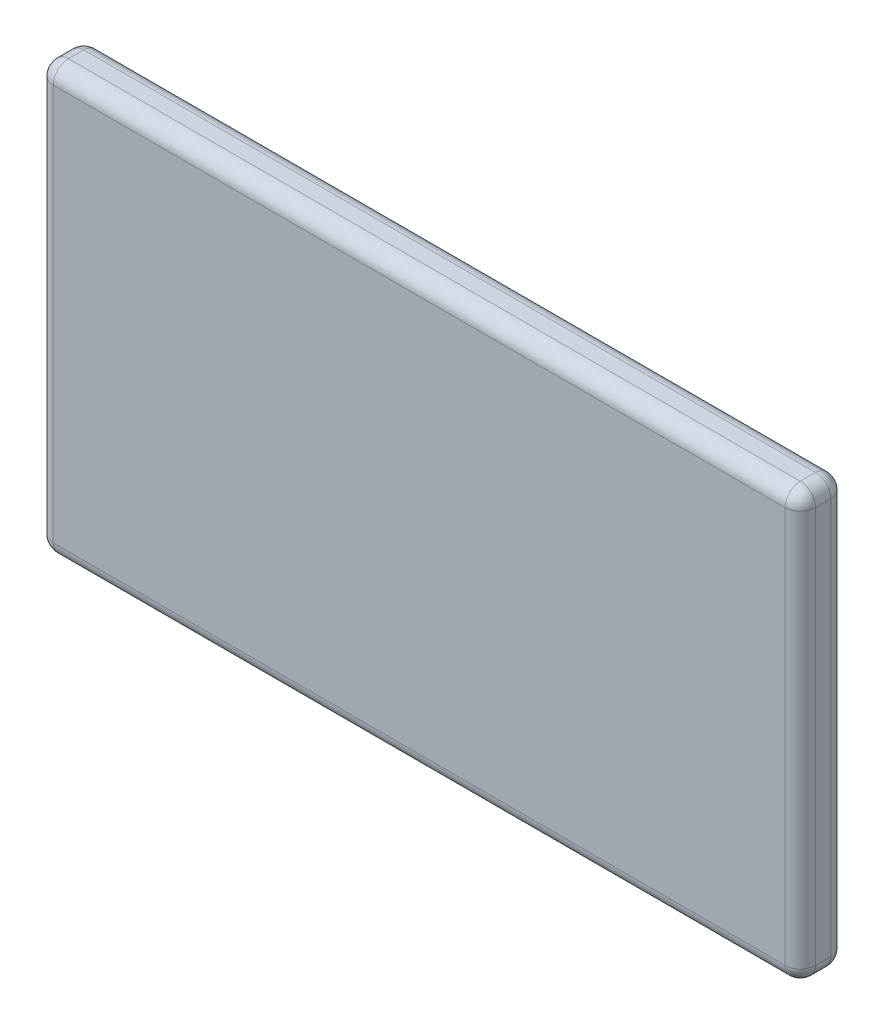
ISO-10303-21;
HEADER;
FILE_DESCRIPTION(('STEP AP214'),'2;1');
FILE_NAME('part.step','',(''),(''),'','','');
FILE_SCHEMA(('AUTOMOTIVE_DESIGN { 1 0 10303 214 1 1 1 1 }'));
ENDSEC;
DATA;
#1=APPLICATION_CONTEXT('core data for automotive mechanical design processes');
#2=APPLICATION_PROTOCOL_DEFINITION('international standard','automotive_design',2000,#1);
#3=PRODUCT_CONTEXT('',#1,'mechanical');
#4=PRODUCT('Part','Part','',(#3));
#5=PRODUCT_RELATED_PRODUCT_CATEGORY('part','',(#4));
#6=PRODUCT_DEFINITION_FORMATION('','',#4);
#7=PRODUCT_DEFINITION_CONTEXT('part definition',#1,'design');
#8=PRODUCT_DEFINITION('design','',#6,#7);
#9=PRODUCT_DEFINITION_SHAPE('','',#8);
#10=(LENGTH_UNIT() NAMED_UNIT(*) SI_UNIT(.MILLI.,.METRE.));
#11=(NAMED_UNIT(*) PLANE_ANGLE_UNIT() SI_UNIT($,.RADIAN.));
#12=(NAMED_UNIT(*) SI_UNIT($,.STERADIAN.) SOLID_ANGLE_UNIT());
#13=UNCERTAINTY_MEASURE_WITH_UNIT(LENGTH_MEASURE(1.E-05),#10,'distance_accuracy_value','');
#14=(GEOMETRIC_REPRESENTATION_CONTEXT(3) GLOBAL_UNCERTAINTY_ASSIGNED_CONTEXT((#13)) GLOBAL_UNIT_ASSIGNED_CONTEXT((#10,
#11,#12)) REPRESENTATION_CONTEXT('',''));
#15=CARTESIAN_POINT('',(0.,0.,0.));
#16=DIRECTION('',(0.,0.,1.));
#17=DIRECTION('',(1.,0.,0.));
#18=AXIS2_PLACEMENT_3D('',#15,#16,#17);
#19=CARTESIAN_POINT('',(-12.5,-7.,1.5));
#20=DIRECTION('',(1.,0.,0.));
#21=DIRECTION('',(0.,0.,-1.));
#22=AXIS2_PLACEMENT_3D('',#19,#20,#21);
#23=PLANE('',#22);
#24=DIRECTION('',(0.,0.,-1.));
#25=VECTOR('',#24,1.);
#26=CARTESIAN_POINT('',(-12.5,6.5,1.5));
#27=LINE('',#26,#25);
#28=CARTESIAN_POINT('',(-12.5,6.5,1.));
#29=VERTEX_POINT('',#28);
#30=CARTESIAN_POINT('',(-12.5,6.5,0.5));
#31=VERTEX_POINT('',#30);
#32=EDGE_CURVE('E185',#29,#31,#27,.T.);
#33=ORIENTED_EDGE('',*,*,#32,.T.);
#34=DIRECTION('',(0.,-1.,0.));
#35=VECTOR('',#34,1.);
#36=CARTESIAN_POINT('',(-12.5,-7.,0.5));
#37=LINE('',#36,#35);
#38=CARTESIAN_POINT('',(-12.5,-6.5,0.5));
#39=VERTEX_POINT('',#38);
#40=EDGE_CURVE('E188',#31,#39,#37,.T.);
#41=ORIENTED_EDGE('',*,*,#40,.T.);
#42=DIRECTION('',(0.,0.,-1.));
#43=VECTOR('',#42,1.);
#44=CARTESIAN_POINT('',(-12.5,-6.5,1.5));
#45=LINE('',#44,#43);
#46=CARTESIAN_POINT('',(-12.5,-6.5,1.));
#47=VERTEX_POINT('',#46);
#48=EDGE_CURVE('E183',#39,#47,#45,.F.);
#49=ORIENTED_EDGE('',*,*,#48,.T.);
#50=DIRECTION('',(0.,-1.,0.));
#51=VECTOR('',#50,1.);
#52=CARTESIAN_POINT('',(-12.5,7.,1.));
#53=LINE('',#52,#51);
#54=EDGE_CURVE('E181',#47,#29,#53,.F.);
#55=ORIENTED_EDGE('',*,*,#54,.T.);
#56=EDGE_LOOP('',(#33,#41,#49,#55));
#57=FACE_BOUND('',#56,.T.);
#58=ADVANCED_FACE('F34',(#57),#23,.F.);
#59=CARTESIAN_POINT('',(12.5,-7.,1.5));
#60=DIRECTION('',(0.,1.,0.));
#61=DIRECTION('',(-1.,0.,0.));
#62=AXIS2_PLACEMENT_3D('',#59,#60,#61);
#63=PLANE('',#62);
#64=DIRECTION('',(0.,0.,-1.));
#65=VECTOR('',#64,1.);
#66=CARTESIAN_POINT('',(12.,-7.,1.5));
#67=LINE('',#66,#65);
#68=CARTESIAN_POINT('',(12.,-7.,0.5));
#69=VERTEX_POINT('',#68);
#70=CARTESIAN_POINT('',(12.,-7.,1.));
#71=VERTEX_POINT('',#70);
#72=EDGE_CURVE('E169',#69,#71,#67,.F.);
#73=ORIENTED_EDGE('',*,*,#72,.T.);
#74=DIRECTION('',(1.,0.,0.));
#75=VECTOR('',#74,1.);
#76=CARTESIAN_POINT('',(-12.5,-7.,1.));
#77=LINE('',#76,#75);
#78=CARTESIAN_POINT('',(-12.,-7.,1.));
#79=VERTEX_POINT('',#78);
#80=EDGE_CURVE('E134',#71,#79,#77,.F.);
#81=ORIENTED_EDGE('',*,*,#80,.T.);
#82=DIRECTION('',(0.,0.,-1.));
#83=VECTOR('',#82,1.);
#84=CARTESIAN_POINT('',(-12.,-7.,1.5));
#85=LINE('',#84,#83);
#86=CARTESIAN_POINT('',(-12.,-7.,0.5));
#87=VERTEX_POINT('',#86);
#88=EDGE_CURVE('E167',#79,#87,#85,.T.);
#89=ORIENTED_EDGE('',*,*,#88,.T.);
#90=DIRECTION('',(1.,0.,0.));
#91=VECTOR('',#90,1.);
#92=CARTESIAN_POINT('',(12.5,-7.,0.5));
#93=LINE('',#92,#91);
#94=EDGE_CURVE('E162',#87,#69,#93,.T.);
#95=ORIENTED_EDGE('',*,*,#94,.T.);
#96=EDGE_LOOP('',(#73,#81,#89,#95));
#97=FACE_BOUND('',#96,.T.);
#98=ADVANCED_FACE('F292',(#97),#63,.F.);
#99=CARTESIAN_POINT('',(12.5,-7.,1.5));
#100=DIRECTION('',(-1.,0.,0.));
#101=DIRECTION('',(0.,0.,1.));
#102=AXIS2_PLACEMENT_3D('',#99,#100,#101);
#103=PLANE('',#102);
#104=DIRECTION('',(0.,0.,-1.));
#105=VECTOR('',#104,1.);
#106=CARTESIAN_POINT('',(12.5,6.5,1.5));
#107=LINE('',#106,#105);
#108=CARTESIAN_POINT('',(12.5,6.5,0.5));
#109=VERTEX_POINT('',#108);
#110=CARTESIAN_POINT('',(12.5,6.5,1.));
#111=VERTEX_POINT('',#110);
#112=EDGE_CURVE('E194',#109,#111,#107,.F.);
#113=ORIENTED_EDGE('',*,*,#112,.T.);
#114=DIRECTION('',(0.,1.,0.));
#115=VECTOR('',#114,1.);
#116=CARTESIAN_POINT('',(12.5,-7.,1.));
#117=LINE('',#116,#115);
#118=CARTESIAN_POINT('',(12.5,-6.5,1.));
#119=VERTEX_POINT('',#118);
#120=EDGE_CURVE('E197',#111,#119,#117,.F.);
#121=ORIENTED_EDGE('',*,*,#120,.T.);
#122=DIRECTION('',(0.,0.,-1.));
#123=VECTOR('',#122,1.);
#124=CARTESIAN_POINT('',(12.5,-6.5,1.5));
#125=LINE('',#124,#123);
#126=CARTESIAN_POINT('',(12.5,-6.5,0.5));
#127=VERTEX_POINT('',#126);
#128=EDGE_CURVE('E192',#119,#127,#125,.T.);
#129=ORIENTED_EDGE('',*,*,#128,.T.);
#130=DIRECTION('',(0.,1.,0.));
#131=VECTOR('',#130,1.);
#132=CARTESIAN_POINT('',(12.5,-7.,0.5));
#133=LINE('',#132,#131);
#134=EDGE_CURVE('E190',#127,#109,#133,.T.);
#135=ORIENTED_EDGE('',*,*,#134,.T.);
#136=EDGE_LOOP('',(#113,#121,#129,#135));
#137=FACE_BOUND('',#136,.T.);
#138=ADVANCED_FACE('F301',(#137),#103,.F.);
#139=CARTESIAN_POINT('',(12.5,7.,1.5));
#140=DIRECTION('',(0.,-1.,0.));
#141=DIRECTION('',(1.,0.,0.));
#142=AXIS2_PLACEMENT_3D('',#139,#140,#141);
#143=PLANE('',#142);
#144=DIRECTION('',(0.,0.,-1.));
#145=VECTOR('',#144,1.);
#146=CARTESIAN_POINT('',(-12.,7.,1.5));
#147=LINE('',#146,#145);
#148=CARTESIAN_POINT('',(-12.,7.,0.5));
#149=VERTEX_POINT('',#148);
#150=CARTESIAN_POINT('',(-12.,7.,1.));
#151=VERTEX_POINT('',#150);
#152=EDGE_CURVE('E176',#149,#151,#147,.F.);
#153=ORIENTED_EDGE('',*,*,#152,.T.);
#154=DIRECTION('',(-1.,0.,0.));
#155=VECTOR('',#154,1.);
#156=CARTESIAN_POINT('',(12.5,7.,1.));
#157=LINE('',#156,#155);
#158=CARTESIAN_POINT('',(12.,7.,1.));
#159=VERTEX_POINT('',#158);
#160=EDGE_CURVE('E178',#151,#159,#157,.F.);
#161=ORIENTED_EDGE('',*,*,#160,.T.);
#162=DIRECTION('',(0.,0.,-1.));
#163=VECTOR('',#162,1.);
#164=CARTESIAN_POINT('',(12.,7.,1.5));
#165=LINE('',#164,#163);
#166=CARTESIAN_POINT('',(12.,7.,0.5));
#167=VERTEX_POINT('',#166);
#168=EDGE_CURVE('E174',#159,#167,#165,.T.);
#169=ORIENTED_EDGE('',*,*,#168,.T.);
#170=DIRECTION('',(-1.,0.,0.));
#171=VECTOR('',#170,1.);
#172=CARTESIAN_POINT('',(12.5,7.,0.5));
#173=LINE('',#172,#171);
#174=EDGE_CURVE('E172',#167,#149,#173,.T.);
#175=ORIENTED_EDGE('',*,*,#174,.T.);
#176=EDGE_LOOP('',(#153,#161,#169,#175));
#177=FACE_BOUND('',#176,.T.);
#178=ADVANCED_FACE('F323',(#177),#143,.F.);
#179=CARTESIAN_POINT('',(0.,0.,1.5));
#180=DIRECTION('',(0.,0.,1.));
#181=DIRECTION('',(1.,0.,0.));
#182=AXIS2_PLACEMENT_3D('',#179,#180,#181);
#183=PLANE('',#182);
#184=DIRECTION('',(-1.,0.,0.));
#185=VECTOR('',#184,1.);
#186=CARTESIAN_POINT('',(-12.5,6.5,1.5));
#187=LINE('',#186,#185);
#188=CARTESIAN_POINT('',(12.,6.5,1.5));
#189=VERTEX_POINT('',#188);
#190=CARTESIAN_POINT('',(-12.,6.5,1.5));
#191=VERTEX_POINT('',#190);
#192=EDGE_CURVE('E155',#189,#191,#187,.T.);
#193=ORIENTED_EDGE('',*,*,#192,.T.);
#194=DIRECTION('',(0.,-1.,0.));
#195=VECTOR('',#194,1.);
#196=CARTESIAN_POINT('',(-12.,-7.,1.5));
#197=LINE('',#196,#195);
#198=CARTESIAN_POINT('',(-12.,-6.5,1.5));
#199=VERTEX_POINT('',#198);
#200=EDGE_CURVE('E159',#191,#199,#197,.T.);
#201=ORIENTED_EDGE('',*,*,#200,.T.);
#202=DIRECTION('',(1.,0.,0.));
#203=VECTOR('',#202,1.);
#204=CARTESIAN_POINT('',(12.5,-6.5,1.5));
#205=LINE('',#204,#203);
#206=CARTESIAN_POINT('',(12.,-6.5,1.5));
#207=VERTEX_POINT('',#206);
#208=EDGE_CURVE('E132',#199,#207,#205,.T.);
#209=ORIENTED_EDGE('',*,*,#208,.T.);
#210=DIRECTION('',(0.,1.,0.));
#211=VECTOR('',#210,1.);
#212=CARTESIAN_POINT('',(12.,7.,1.5));
#213=LINE('',#212,#211);
#214=EDGE_CURVE('E149',#207,#189,#213,.T.);
#215=ORIENTED_EDGE('',*,*,#214,.T.);
#216=EDGE_LOOP('',(#193,#201,#209,#215));
#217=FACE_BOUND('',#216,.T.);
#218=ADVANCED_FACE('F157',(#217),#183,.T.);
#219=CARTESIAN_POINT('',(0.,0.,0.));
#220=DIRECTION('',(0.,0.,1.));
#221=DIRECTION('',(1.,0.,0.));
#222=AXIS2_PLACEMENT_3D('',#219,#220,#221);
#223=PLANE('',#222);
#224=DIRECTION('',(0.,1.,0.));
#225=VECTOR('',#224,1.);
#226=CARTESIAN_POINT('',(12.,0.,0.));
#227=LINE('',#226,#225);
#228=CARTESIAN_POINT('',(12.,6.5,0.));
#229=VERTEX_POINT('',#228);
#230=CARTESIAN_POINT('',(12.,-6.5,0.));
#231=VERTEX_POINT('',#230);
#232=EDGE_CURVE('E58',#229,#231,#227,.F.);
#233=ORIENTED_EDGE('',*,*,#232,.T.);
#234=DIRECTION('',(1.,0.,0.));
#235=VECTOR('',#234,1.);
#236=CARTESIAN_POINT('',(0.,-6.5,0.));
#237=LINE('',#236,#235);
#238=CARTESIAN_POINT('',(-12.,-6.5,0.));
#239=VERTEX_POINT('',#238);
#240=EDGE_CURVE('E11',#231,#239,#237,.F.);
#241=ORIENTED_EDGE('',*,*,#240,.T.);
#242=DIRECTION('',(0.,-1.,0.));
#243=VECTOR('',#242,1.);
#244=CARTESIAN_POINT('',(-12.,0.,0.));
#245=LINE('',#244,#243);
#246=CARTESIAN_POINT('',(-12.,6.5,0.));
#247=VERTEX_POINT('',#246);
#248=EDGE_CURVE('E43',#239,#247,#245,.F.);
#249=ORIENTED_EDGE('',*,*,#248,.T.);
#250=DIRECTION('',(-1.,0.,0.));
#251=VECTOR('',#250,1.);
#252=CARTESIAN_POINT('',(0.,6.5,0.));
#253=LINE('',#252,#251);
#254=EDGE_CURVE('E199',#247,#229,#253,.F.);
#255=ORIENTED_EDGE('',*,*,#254,.T.);
#256=EDGE_LOOP('',(#233,#241,#249,#255));
#257=FACE_BOUND('',#256,.T.);
#258=ADVANCED_FACE('F309',(#257),#223,.F.);
#259=CARTESIAN_POINT('',(12.5,6.5,0.5));
#260=DIRECTION('',(-1.,0.,0.));
#261=DIRECTION('',(0.,-1.,0.));
#262=AXIS2_PLACEMENT_3D('',#259,#260,#261);
#263=CYLINDRICAL_SURFACE('',#262,0.5);
#264=CARTESIAN_POINT('',(-12.,6.5,0.5));
#265=DIRECTION('',(-1.,0.,0.));
#266=DIRECTION('',(0.,0.,1.));
#267=AXIS2_PLACEMENT_3D('',#264,#265,#266);
#268=CIRCLE('',#267,0.5);
#269=EDGE_CURVE('E38',#149,#247,#268,.T.);
#270=ORIENTED_EDGE('',*,*,#269,.F.);
#271=ORIENTED_EDGE('',*,*,#174,.F.);
#272=CARTESIAN_POINT('',(12.,6.5,0.5));
#273=DIRECTION('',(1.,0.,0.));
#274=DIRECTION('',(0.,0.,-1.));
#275=AXIS2_PLACEMENT_3D('',#272,#273,#274);
#276=CIRCLE('',#275,0.5);
#277=EDGE_CURVE('E251',#229,#167,#276,.T.);
#278=ORIENTED_EDGE('',*,*,#277,.F.);
#279=ORIENTED_EDGE('',*,*,#254,.F.);
#280=EDGE_LOOP('',(#270,#271,#278,#279));
#281=FACE_BOUND('',#280,.T.);
#282=ADVANCED_FACE('F36',(#281),#263,.T.);
#283=CARTESIAN_POINT('',(-12.,6.5,0.5));
#284=DIRECTION('',(0.,0.,1.));
#285=DIRECTION('',(1.,0.,0.));
#286=AXIS2_PLACEMENT_3D('',#283,#284,#285);
#287=SPHERICAL_SURFACE('',#286,0.5);
#288=CARTESIAN_POINT('',(-12.,6.5,0.5));
#289=DIRECTION('',(0.,0.,-1.));
#290=DIRECTION('',(-1.,0.,0.));
#291=AXIS2_PLACEMENT_3D('',#288,#289,#290);
#292=CIRCLE('',#291,0.5);
#293=EDGE_CURVE('E246',#149,#31,#292,.F.);
#294=ORIENTED_EDGE('',*,*,#293,.F.);
#295=ORIENTED_EDGE('',*,*,#269,.T.);
#296=CARTESIAN_POINT('',(-12.,6.5,0.5));
#297=DIRECTION('',(0.,1.,0.));
#298=DIRECTION('',(-1.,0.,0.));
#299=AXIS2_PLACEMENT_3D('',#296,#297,#298);
#300=CIRCLE('',#299,0.5);
#301=EDGE_CURVE('E249',#31,#247,#300,.F.);
#302=ORIENTED_EDGE('',*,*,#301,.F.);
#303=EDGE_LOOP('',(#294,#295,#302));
#304=FACE_BOUND('',#303,.T.);
#305=ADVANCED_FACE('F262',(#304),#287,.T.);
#306=CARTESIAN_POINT('',(12.,6.5,0.5));
#307=DIRECTION('',(0.,0.,1.));
#308=DIRECTION('',(1.,0.,0.));
#309=AXIS2_PLACEMENT_3D('',#306,#307,#308);
#310=SPHERICAL_SURFACE('',#309,0.5);
#311=CARTESIAN_POINT('',(12.,6.5,0.5));
#312=DIRECTION('',(0.,1.,0.));
#313=DIRECTION('',(0.,0.,1.));
#314=AXIS2_PLACEMENT_3D('',#311,#312,#313);
#315=CIRCLE('',#314,0.5);
#316=EDGE_CURVE('E240',#229,#109,#315,.F.);
#317=ORIENTED_EDGE('',*,*,#316,.F.);
#318=ORIENTED_EDGE('',*,*,#277,.T.);
#319=CARTESIAN_POINT('',(12.,6.5,0.5));
#320=DIRECTION('',(0.,0.,-1.));
#321=DIRECTION('',(-1.,0.,0.));
#322=AXIS2_PLACEMENT_3D('',#319,#320,#321);
#323=CIRCLE('',#322,0.5);
#324=EDGE_CURVE('E243',#109,#167,#323,.F.);
#325=ORIENTED_EDGE('',*,*,#324,.F.);
#326=EDGE_LOOP('',(#317,#318,#325));
#327=FACE_BOUND('',#326,.T.);
#328=ADVANCED_FACE('F310',(#327),#310,.T.);
#329=CARTESIAN_POINT('',(-12.,-7.,0.5));
#330=DIRECTION('',(0.,-1.,0.));
#331=DIRECTION('',(0.,0.,-1.));
#332=AXIS2_PLACEMENT_3D('',#329,#330,#331);
#333=CYLINDRICAL_SURFACE('',#332,0.5);
#334=ORIENTED_EDGE('',*,*,#301,.T.);
#335=ORIENTED_EDGE('',*,*,#248,.F.);
#336=CARTESIAN_POINT('',(-12.,-6.5,0.5));
#337=DIRECTION('',(0.,-1.,0.));
#338=DIRECTION('',(0.,0.,-1.));
#339=AXIS2_PLACEMENT_3D('',#336,#337,#338);
#340=CIRCLE('',#339,0.5);
#341=EDGE_CURVE('E51',#39,#239,#340,.T.);
#342=ORIENTED_EDGE('',*,*,#341,.F.);
#343=ORIENTED_EDGE('',*,*,#40,.F.);
#344=EDGE_LOOP('',(#334,#335,#342,#343));
#345=FACE_BOUND('',#344,.T.);
#346=ADVANCED_FACE('F269',(#345),#333,.T.);
#347=CARTESIAN_POINT('',(-12.,6.5,1.5));
#348=DIRECTION('',(0.,0.,-1.));
#349=DIRECTION('',(-1.,0.,0.));
#350=AXIS2_PLACEMENT_3D('',#347,#348,#349);
#351=CYLINDRICAL_SURFACE('',#350,0.5);
#352=ORIENTED_EDGE('',*,*,#293,.T.);
#353=ORIENTED_EDGE('',*,*,#32,.F.);
#354=CARTESIAN_POINT('',(-12.,6.5,1.));
#355=DIRECTION('',(0.,0.,1.));
#356=DIRECTION('',(1.,0.,0.));
#357=AXIS2_PLACEMENT_3D('',#354,#355,#356);
#358=CIRCLE('',#357,0.5);
#359=EDGE_CURVE('E234',#151,#29,#358,.T.);
#360=ORIENTED_EDGE('',*,*,#359,.F.);
#361=ORIENTED_EDGE('',*,*,#152,.F.);
#362=EDGE_LOOP('',(#352,#353,#360,#361));
#363=FACE_BOUND('',#362,.T.);
#364=ADVANCED_FACE('F276',(#363),#351,.T.);
#365=CARTESIAN_POINT('',(0.,6.5,1.));
#366=DIRECTION('',(1.,0.,0.));
#367=DIRECTION('',(0.,1.,0.));
#368=AXIS2_PLACEMENT_3D('',#365,#366,#367);
#369=CYLINDRICAL_SURFACE('',#368,0.5);
#370=CARTESIAN_POINT('',(12.,6.5,1.));
#371=DIRECTION('',(1.,0.,0.));
#372=DIRECTION('',(0.,0.,-1.));
#373=AXIS2_PLACEMENT_3D('',#370,#371,#372);
#374=CIRCLE('',#373,0.5);
#375=EDGE_CURVE('E228',#159,#189,#374,.T.);
#376=ORIENTED_EDGE('',*,*,#375,.F.);
#377=ORIENTED_EDGE('',*,*,#160,.F.);
#378=CARTESIAN_POINT('',(-12.,6.5,1.));
#379=DIRECTION('',(-1.,0.,0.));
#380=DIRECTION('',(0.,0.,1.));
#381=AXIS2_PLACEMENT_3D('',#378,#379,#380);
#382=CIRCLE('',#381,0.5);
#383=EDGE_CURVE('E231',#191,#151,#382,.T.);
#384=ORIENTED_EDGE('',*,*,#383,.F.);
#385=ORIENTED_EDGE('',*,*,#192,.F.);
#386=EDGE_LOOP('',(#376,#377,#384,#385));
#387=FACE_BOUND('',#386,.T.);
#388=ADVANCED_FACE('F321',(#387),#369,.T.);
#389=CARTESIAN_POINT('',(12.,6.5,1.5));
#390=DIRECTION('',(0.,0.,-1.));
#391=DIRECTION('',(-1.,0.,0.));
#392=AXIS2_PLACEMENT_3D('',#389,#390,#391);
#393=CYLINDRICAL_SURFACE('',#392,0.5);
#394=ORIENTED_EDGE('',*,*,#324,.T.);
#395=ORIENTED_EDGE('',*,*,#168,.F.);
#396=CARTESIAN_POINT('',(12.,6.5,1.));
#397=DIRECTION('',(0.,0.,1.));
#398=DIRECTION('',(1.,0.,0.));
#399=AXIS2_PLACEMENT_3D('',#396,#397,#398);
#400=CIRCLE('',#399,0.5);
#401=EDGE_CURVE('E226',#111,#159,#400,.T.);
#402=ORIENTED_EDGE('',*,*,#401,.F.);
#403=ORIENTED_EDGE('',*,*,#112,.F.);
#404=EDGE_LOOP('',(#394,#395,#402,#403));
#405=FACE_BOUND('',#404,.T.);
#406=ADVANCED_FACE('F315',(#405),#393,.T.);
#407=CARTESIAN_POINT('',(12.,-7.,0.5));
#408=DIRECTION('',(0.,1.,0.));
#409=DIRECTION('',(0.,0.,1.));
#410=AXIS2_PLACEMENT_3D('',#407,#408,#409);
#411=CYLINDRICAL_SURFACE('',#410,0.5);
#412=ORIENTED_EDGE('',*,*,#316,.T.);
#413=ORIENTED_EDGE('',*,*,#134,.F.);
#414=CARTESIAN_POINT('',(12.,-6.5,0.5));
#415=DIRECTION('',(0.,-1.,0.));
#416=DIRECTION('',(0.,0.,-1.));
#417=AXIS2_PLACEMENT_3D('',#414,#415,#416);
#418=CIRCLE('',#417,0.5);
#419=EDGE_CURVE('E223',#231,#127,#418,.T.);
#420=ORIENTED_EDGE('',*,*,#419,.F.);
#421=ORIENTED_EDGE('',*,*,#232,.F.);
#422=EDGE_LOOP('',(#412,#413,#420,#421));
#423=FACE_BOUND('',#422,.T.);
#424=ADVANCED_FACE('F304',(#423),#411,.T.);
#425=CARTESIAN_POINT('',(12.5,-6.5,0.5));
#426=DIRECTION('',(1.,0.,0.));
#427=DIRECTION('',(0.,1.,0.));
#428=AXIS2_PLACEMENT_3D('',#425,#426,#427);
#429=CYLINDRICAL_SURFACE('',#428,0.5);
#430=CARTESIAN_POINT('',(-12.,-6.5,0.5));
#431=DIRECTION('',(-1.,0.,0.));
#432=DIRECTION('',(0.,0.,1.));
#433=AXIS2_PLACEMENT_3D('',#430,#431,#432);
#434=CIRCLE('',#433,0.5);
#435=EDGE_CURVE('E238',#239,#87,#434,.T.);
#436=ORIENTED_EDGE('',*,*,#435,.F.);
#437=ORIENTED_EDGE('',*,*,#240,.F.);
#438=CARTESIAN_POINT('',(12.,-6.5,0.5));
#439=DIRECTION('',(1.,0.,0.));
#440=DIRECTION('',(0.,0.,-1.));
#441=AXIS2_PLACEMENT_3D('',#438,#439,#440);
#442=CIRCLE('',#441,0.5);
#443=EDGE_CURVE('E220',#69,#231,#442,.T.);
#444=ORIENTED_EDGE('',*,*,#443,.F.);
#445=ORIENTED_EDGE('',*,*,#94,.F.);
#446=EDGE_LOOP('',(#436,#437,#444,#445));
#447=FACE_BOUND('',#446,.T.);
#448=ADVANCED_FACE('F308',(#447),#429,.T.);
#449=CARTESIAN_POINT('',(-12.,-6.5,0.5));
#450=DIRECTION('',(0.,0.,1.));
#451=DIRECTION('',(1.,0.,0.));
#452=AXIS2_PLACEMENT_3D('',#449,#450,#451);
#453=SPHERICAL_SURFACE('',#452,0.5);
#454=ORIENTED_EDGE('',*,*,#341,.T.);
#455=ORIENTED_EDGE('',*,*,#435,.T.);
#456=CARTESIAN_POINT('',(-12.,-6.5,0.5));
#457=DIRECTION('',(0.,0.,-1.));
#458=DIRECTION('',(-1.,0.,0.));
#459=AXIS2_PLACEMENT_3D('',#456,#457,#458);
#460=CIRCLE('',#459,0.5);
#461=EDGE_CURVE('E217',#39,#87,#460,.F.);
#462=ORIENTED_EDGE('',*,*,#461,.F.);
#463=EDGE_LOOP('',(#454,#455,#462));
#464=FACE_BOUND('',#463,.T.);
#465=ADVANCED_FACE('F360',(#464),#453,.T.);
#466=CARTESIAN_POINT('',(-12.,6.5,1.));
#467=DIRECTION('',(0.,0.,1.));
#468=DIRECTION('',(1.,0.,0.));
#469=AXIS2_PLACEMENT_3D('',#466,#467,#468);
#470=SPHERICAL_SURFACE('',#469,0.5);
#471=ORIENTED_EDGE('',*,*,#383,.T.);
#472=ORIENTED_EDGE('',*,*,#359,.T.);
#473=CARTESIAN_POINT('',(-12.,6.5,1.));
#474=DIRECTION('',(0.,1.,0.));
#475=DIRECTION('',(0.,0.,1.));
#476=AXIS2_PLACEMENT_3D('',#473,#474,#475);
#477=CIRCLE('',#476,0.5);
#478=EDGE_CURVE('E214',#191,#29,#477,.F.);
#479=ORIENTED_EDGE('',*,*,#478,.F.);
#480=EDGE_LOOP('',(#471,#472,#479));
#481=FACE_BOUND('',#480,.T.);
#482=ADVANCED_FACE('F279',(#481),#470,.T.);
#483=CARTESIAN_POINT('',(12.,6.5,1.));
#484=DIRECTION('',(0.,0.,1.));
#485=DIRECTION('',(1.,0.,0.));
#486=AXIS2_PLACEMENT_3D('',#483,#484,#485);
#487=SPHERICAL_SURFACE('',#486,0.5);
#488=ORIENTED_EDGE('',*,*,#401,.T.);
#489=ORIENTED_EDGE('',*,*,#375,.T.);
#490=CARTESIAN_POINT('',(12.,6.5,1.));
#491=DIRECTION('',(0.,1.,0.));
#492=DIRECTION('',(0.,0.,1.));
#493=AXIS2_PLACEMENT_3D('',#490,#491,#492);
#494=CIRCLE('',#493,0.5);
#495=EDGE_CURVE('E152',#111,#189,#494,.F.);
#496=ORIENTED_EDGE('',*,*,#495,.F.);
#497=EDGE_LOOP('',(#488,#489,#496));
#498=FACE_BOUND('',#497,.T.);
#499=ADVANCED_FACE('F318',(#498),#487,.T.);
#500=CARTESIAN_POINT('',(12.,-6.5,0.5));
#501=DIRECTION('',(0.,0.,1.));
#502=DIRECTION('',(1.,0.,0.));
#503=AXIS2_PLACEMENT_3D('',#500,#501,#502);
#504=SPHERICAL_SURFACE('',#503,0.5);
#505=ORIENTED_EDGE('',*,*,#443,.T.);
#506=ORIENTED_EDGE('',*,*,#419,.T.);
#507=CARTESIAN_POINT('',(12.,-6.5,0.5));
#508=DIRECTION('',(0.,0.,-1.));
#509=DIRECTION('',(-1.,0.,0.));
#510=AXIS2_PLACEMENT_3D('',#507,#508,#509);
#511=CIRCLE('',#510,0.5);
#512=EDGE_CURVE('E210',#69,#127,#511,.F.);
#513=ORIENTED_EDGE('',*,*,#512,.F.);
#514=EDGE_LOOP('',(#505,#506,#513));
#515=FACE_BOUND('',#514,.T.);
#516=ADVANCED_FACE('F306',(#515),#504,.T.);
#517=CARTESIAN_POINT('',(-12.,-6.5,1.5));
#518=DIRECTION('',(0.,0.,-1.));
#519=DIRECTION('',(-1.,0.,0.));
#520=AXIS2_PLACEMENT_3D('',#517,#518,#519);
#521=CYLINDRICAL_SURFACE('',#520,0.5);
#522=ORIENTED_EDGE('',*,*,#461,.T.);
#523=ORIENTED_EDGE('',*,*,#88,.F.);
#524=CARTESIAN_POINT('',(-12.,-6.5,1.));
#525=DIRECTION('',(0.,0.,1.));
#526=DIRECTION('',(1.,0.,0.));
#527=AXIS2_PLACEMENT_3D('',#524,#525,#526);
#528=CIRCLE('',#527,0.5);
#529=EDGE_CURVE('E207',#47,#79,#528,.T.);
#530=ORIENTED_EDGE('',*,*,#529,.F.);
#531=ORIENTED_EDGE('',*,*,#48,.F.);
#532=EDGE_LOOP('',(#522,#523,#530,#531));
#533=FACE_BOUND('',#532,.T.);
#534=ADVANCED_FACE('F289',(#533),#521,.T.);
#535=CARTESIAN_POINT('',(-12.,0.,1.));
#536=DIRECTION('',(0.,1.,0.));
#537=DIRECTION('',(0.,0.,1.));
#538=AXIS2_PLACEMENT_3D('',#535,#536,#537);
#539=CYLINDRICAL_SURFACE('',#538,0.5);
#540=ORIENTED_EDGE('',*,*,#478,.T.);
#541=ORIENTED_EDGE('',*,*,#54,.F.);
#542=CARTESIAN_POINT('',(-12.,-6.5,1.));
#543=DIRECTION('',(0.,-1.,0.));
#544=DIRECTION('',(0.,0.,-1.));
#545=AXIS2_PLACEMENT_3D('',#542,#543,#544);
#546=CIRCLE('',#545,0.5);
#547=EDGE_CURVE('E146',#199,#47,#546,.T.);
#548=ORIENTED_EDGE('',*,*,#547,.F.);
#549=ORIENTED_EDGE('',*,*,#200,.F.);
#550=EDGE_LOOP('',(#540,#541,#548,#549));
#551=FACE_BOUND('',#550,.T.);
#552=ADVANCED_FACE('F282',(#551),#539,.T.);
#553=CARTESIAN_POINT('',(12.,0.,1.));
#554=DIRECTION('',(0.,-1.,0.));
#555=DIRECTION('',(0.,0.,-1.));
#556=AXIS2_PLACEMENT_3D('',#553,#554,#555);
#557=CYLINDRICAL_SURFACE('',#556,0.5);
#558=ORIENTED_EDGE('',*,*,#495,.T.);
#559=ORIENTED_EDGE('',*,*,#214,.F.);
#560=CARTESIAN_POINT('',(12.,-6.5,1.));
#561=DIRECTION('',(0.,-1.,0.));
#562=DIRECTION('',(0.,0.,-1.));
#563=AXIS2_PLACEMENT_3D('',#560,#561,#562);
#564=CIRCLE('',#563,0.5);
#565=EDGE_CURVE('E140',#119,#207,#564,.T.);
#566=ORIENTED_EDGE('',*,*,#565,.F.);
#567=ORIENTED_EDGE('',*,*,#120,.F.);
#568=EDGE_LOOP('',(#558,#559,#566,#567));
#569=FACE_BOUND('',#568,.T.);
#570=ADVANCED_FACE('F150',(#569),#557,.T.);
#571=CARTESIAN_POINT('',(12.,-6.5,1.5));
#572=DIRECTION('',(0.,0.,-1.));
#573=DIRECTION('',(-1.,0.,0.));
#574=AXIS2_PLACEMENT_3D('',#571,#572,#573);
#575=CYLINDRICAL_SURFACE('',#574,0.5);
#576=ORIENTED_EDGE('',*,*,#512,.T.);
#577=ORIENTED_EDGE('',*,*,#128,.F.);
#578=CARTESIAN_POINT('',(12.,-6.5,1.));
#579=DIRECTION('',(0.,0.,1.));
#580=DIRECTION('',(1.,0.,0.));
#581=AXIS2_PLACEMENT_3D('',#578,#579,#580);
#582=CIRCLE('',#581,0.5);
#583=EDGE_CURVE('E144',#71,#119,#582,.T.);
#584=ORIENTED_EDGE('',*,*,#583,.F.);
#585=ORIENTED_EDGE('',*,*,#72,.F.);
#586=EDGE_LOOP('',(#576,#577,#584,#585));
#587=FACE_BOUND('',#586,.T.);
#588=ADVANCED_FACE('F297',(#587),#575,.T.);
#589=CARTESIAN_POINT('',(-12.,-6.5,1.));
#590=DIRECTION('',(0.,0.,1.));
#591=DIRECTION('',(1.,0.,0.));
#592=AXIS2_PLACEMENT_3D('',#589,#590,#591);
#593=SPHERICAL_SURFACE('',#592,0.5);
#594=ORIENTED_EDGE('',*,*,#547,.T.);
#595=ORIENTED_EDGE('',*,*,#529,.T.);
#596=CARTESIAN_POINT('',(-12.,-6.5,1.));
#597=DIRECTION('',(-1.,0.,0.));
#598=DIRECTION('',(0.,0.,1.));
#599=AXIS2_PLACEMENT_3D('',#596,#597,#598);
#600=CIRCLE('',#599,0.5);
#601=EDGE_CURVE('E137',#199,#79,#600,.F.);
#602=ORIENTED_EDGE('',*,*,#601,.F.);
#603=EDGE_LOOP('',(#594,#595,#602));
#604=FACE_BOUND('',#603,.T.);
#605=ADVANCED_FACE('F286',(#604),#593,.T.);
#606=CARTESIAN_POINT('',(12.,-6.5,1.));
#607=DIRECTION('',(0.,0.,1.));
#608=DIRECTION('',(1.,0.,0.));
#609=AXIS2_PLACEMENT_3D('',#606,#607,#608);
#610=SPHERICAL_SURFACE('',#609,0.5);
#611=ORIENTED_EDGE('',*,*,#583,.T.);
#612=ORIENTED_EDGE('',*,*,#565,.T.);
#613=CARTESIAN_POINT('',(12.,-6.5,1.));
#614=DIRECTION('',(1.,0.,0.));
#615=DIRECTION('',(0.,0.,-1.));
#616=AXIS2_PLACEMENT_3D('',#613,#614,#615);
#617=CIRCLE('',#616,0.5);
#618=EDGE_CURVE('E128',#71,#207,#617,.F.);
#619=ORIENTED_EDGE('',*,*,#618,.F.);
#620=EDGE_LOOP('',(#611,#612,#619));
#621=FACE_BOUND('',#620,.T.);
#622=ADVANCED_FACE('F142',(#621),#610,.T.);
#623=CARTESIAN_POINT('',(0.,-6.5,1.));
#624=DIRECTION('',(-1.,0.,0.));
#625=DIRECTION('',(0.,-1.,0.));
#626=AXIS2_PLACEMENT_3D('',#623,#624,#625);
#627=CYLINDRICAL_SURFACE('',#626,0.5);
#628=ORIENTED_EDGE('',*,*,#601,.T.);
#629=ORIENTED_EDGE('',*,*,#80,.F.);
#630=ORIENTED_EDGE('',*,*,#618,.T.);
#631=ORIENTED_EDGE('',*,*,#208,.F.);
#632=EDGE_LOOP('',(#628,#629,#630,#631));
#633=FACE_BOUND('',#632,.T.);
#634=ADVANCED_FACE('F130',(#633),#627,.T.);
#635=CLOSED_SHELL('',(#58,#98,#138,#178,#218,#258,#282,#305,#328,#346,#364,#388,#406,#424,#448,
#465,#482,#499,#516,#534,#552,#570,#588,#605,#622,#634));
#636=MANIFOLD_SOLID_BREP('B2',#635);
#637=ADVANCED_BREP_SHAPE_REPRESENTATION('',(#18,#636),#14);
#638=SHAPE_DEFINITION_REPRESENTATION(#9,#637);
ENDSEC;
END-ISO-10303-21;
